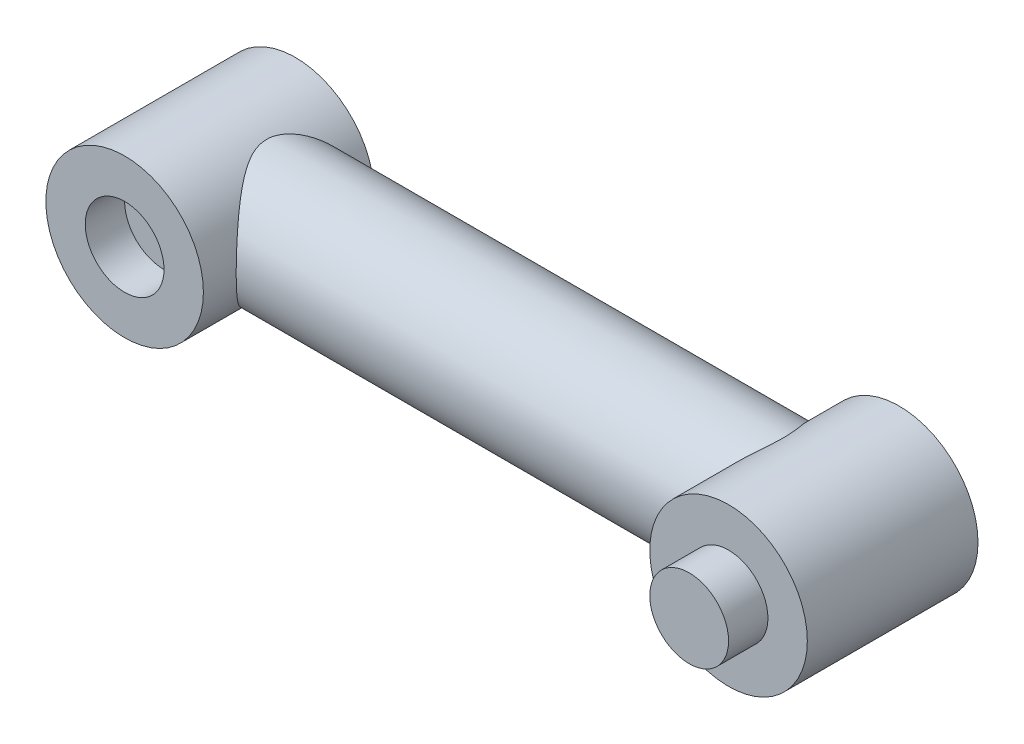
ISO-10303-21;
HEADER;
FILE_DESCRIPTION(('STEP AP214'),'2;1');
FILE_NAME('part.step','',(''),(''),'','','');
FILE_SCHEMA(('AUTOMOTIVE_DESIGN { 1 0 10303 214 1 1 1 1 }'));
ENDSEC;
DATA;
#1=APPLICATION_CONTEXT('core data for automotive mechanical design processes');
#2=APPLICATION_PROTOCOL_DEFINITION('international standard','automotive_design',2000,#1);
#3=PRODUCT_CONTEXT('',#1,'mechanical');
#4=PRODUCT('Part','Part','',(#3));
#5=PRODUCT_RELATED_PRODUCT_CATEGORY('part','',(#4));
#6=PRODUCT_DEFINITION_FORMATION('','',#4);
#7=PRODUCT_DEFINITION_CONTEXT('part definition',#1,'design');
#8=PRODUCT_DEFINITION('design','',#6,#7);
#9=PRODUCT_DEFINITION_SHAPE('','',#8);
#10=(LENGTH_UNIT() NAMED_UNIT(*) SI_UNIT(.MILLI.,.METRE.));
#11=(NAMED_UNIT(*) PLANE_ANGLE_UNIT() SI_UNIT($,.RADIAN.));
#12=(NAMED_UNIT(*) SI_UNIT($,.STERADIAN.) SOLID_ANGLE_UNIT());
#13=UNCERTAINTY_MEASURE_WITH_UNIT(LENGTH_MEASURE(1.E-05),#10,'distance_accuracy_value','');
#14=(GEOMETRIC_REPRESENTATION_CONTEXT(3) GLOBAL_UNCERTAINTY_ASSIGNED_CONTEXT((#13)) GLOBAL_UNIT_ASSIGNED_CONTEXT((#10,
#11,#12)) REPRESENTATION_CONTEXT('',''));
#15=CARTESIAN_POINT('',(0.,0.,0.));
#16=DIRECTION('',(0.,0.,1.));
#17=DIRECTION('',(1.,0.,0.));
#18=AXIS2_PLACEMENT_3D('',#15,#16,#17);
#19=CARTESIAN_POINT('',(213.416876048223,0.,0.));
#20=DIRECTION('',(1.,0.,0.));
#21=DIRECTION('',(0.,1.,0.));
#22=AXIS2_PLACEMENT_3D('',#19,#20,#21);
#23=CYLINDRICAL_SURFACE('',#22,25.);
#24=CARTESIAN_POINT('',(16.583123951777,25.,0.));
#25=CARTESIAN_POINT('',(16.5831366012148,24.9999952323958,0.441781824220458));
#26=CARTESIAN_POINT('',(16.6008708258448,24.9882561466221,0.883691822200362));
#27=CARTESIAN_POINT('',(16.670869464227,24.9416076420471,1.76370356610239));
#28=CARTESIAN_POINT('',(16.7231561656788,24.9066832677603,2.20180266892448));
#29=CARTESIAN_POINT('',(16.8597435924825,24.8144273754709,3.07182587541002));
#30=CARTESIAN_POINT('',(16.9441354241366,24.7570320769957,3.50372874225016));
#31=CARTESIAN_POINT('',(17.1410488546996,24.6211028885814,4.35755533371882));
#32=CARTESIAN_POINT('',(17.2535706469161,24.542568853378,4.77947898974898));
#33=CARTESIAN_POINT('',(17.5507240941017,24.3313967373396,5.77337353246251));
#34=CARTESIAN_POINT('',(17.7463993007367,24.1895871358199,6.3400961290561));
#35=CARTESIAN_POINT('',(18.1725513730177,23.8710930763065,7.45015470091193));
#36=CARTESIAN_POINT('',(18.4030461379086,23.6943906669795,7.99347846215703));
#37=CARTESIAN_POINT('',(18.8898181871748,23.308186615318,9.05814113569544));
#38=CARTESIAN_POINT('',(19.1461614549258,23.0986002319974,9.5794187025486));
#39=CARTESIAN_POINT('',(19.6762444124787,22.6487581917004,10.5992630499084));
#40=CARTESIAN_POINT('',(19.9499832834552,22.4085039777479,11.0978308974865));
#41=CARTESIAN_POINT('',(20.4311114544092,21.9691717213928,11.9379069848718));
#42=CARTESIAN_POINT('',(20.6358628462615,21.7771363848563,12.2846479217804));
#43=CARTESIAN_POINT('',(21.049186719466,21.3778939443505,12.9669531617967));
#44=CARTESIAN_POINT('',(21.2577595016544,21.1706856420194,13.3025165790515));
#45=CARTESIAN_POINT('',(21.8866463423768,20.526435251427,14.2928751210657));
#46=CARTESIAN_POINT('',(22.310063862815,20.0668261215966,14.9312271261069));
#47=CARTESIAN_POINT('',(23.1524695198848,19.088736163492,16.1628549930544));
#48=CARTESIAN_POINT('',(23.5714613660388,18.5703097695754,16.756171698975));
#49=CARTESIAN_POINT('',(24.3950323232926,17.4743220550127,17.8961661287464));
#50=CARTESIAN_POINT('',(24.7996168531044,16.8967832905307,18.4428614975185));
#51=CARTESIAN_POINT('',(25.5013775767801,15.8115240251136,19.3750639999918));
#52=CARTESIAN_POINT('',(25.8031338093393,15.3149777313448,19.7701647855466));
#53=CARTESIAN_POINT('',(26.3869669607359,14.2855861420082,20.5263191601657));
#54=CARTESIAN_POINT('',(26.6690446401102,13.7527422508454,20.8873740652255));
#55=CARTESIAN_POINT('',(27.2083019574202,12.6523997522784,21.5716470794608));
#56=CARTESIAN_POINT('',(27.4655138343237,12.0849476160668,21.8949142980233));
#57=CARTESIAN_POINT('',(27.9505030707714,10.9164669156548,22.5002986153881));
#58=CARTESIAN_POINT('',(28.1782857695565,10.3154444704283,22.7824231797688));
#59=CARTESIAN_POINT('',(28.5630817900107,9.18916623812263,23.2565113693688));
#60=CARTESIAN_POINT('',(28.7255222542841,8.66876856508447,23.4556303789023));
#61=CARTESIAN_POINT('',(29.0242113473194,7.60907739098481,23.820491829397));
#62=CARTESIAN_POINT('',(29.1604627370124,7.06978588886235,23.9862377887333));
#63=CARTESIAN_POINT('',(29.4042410606824,5.97534612550057,24.2820181458207));
#64=CARTESIAN_POINT('',(29.5117793420398,5.42020422461485,24.4120666517273));
#65=CARTESIAN_POINT('',(29.6960664846776,4.29735681504332,24.6345337140493));
#66=CARTESIAN_POINT('',(29.7728149917292,3.7296511618939,24.7269518375366));
#67=CARTESIAN_POINT('',(29.894143469515,2.58335712417406,24.8729063485372));
#68=CARTESIAN_POINT('',(29.9385856359746,2.00473279727435,24.9262761798646));
#69=CARTESIAN_POINT('',(29.9937700148802,0.843555485097898,24.9925304350828));
#70=CARTESIAN_POINT('',(30.004512158351,0.261002491782618,25.0054147761103));
#71=CARTESIAN_POINT('',(29.9920509076249,-0.903202051647411,24.9904608510635));
#72=CARTESIAN_POINT('',(29.9688480231611,-1.48485361516712,24.9626231964881));
#73=CARTESIAN_POINT('',(29.8890255863092,-2.64249019821805,24.8667359509782));
#74=CARTESIAN_POINT('',(29.8324071752802,-3.21847541060917,24.7986877334977));
#75=CARTESIAN_POINT('',(29.6919115029042,-4.32188063352001,24.6294877029326));
#76=CARTESIAN_POINT('',(29.610124520965,-4.84996084451036,24.5308711450691));
#77=CARTESIAN_POINT('',(29.4200820524584,-5.89409387890169,24.3011397504591));
#78=CARTESIAN_POINT('',(29.3118280335976,-6.41014736749658,24.170026715771));
#79=CARTESIAN_POINT('',(29.0706941299152,-7.42752244505315,23.8770220407384));
#80=CARTESIAN_POINT('',(28.9378136081431,-7.92884365258403,23.715129604299));
#81=CARTESIAN_POINT('',(28.6495140035056,-8.91454373106408,23.3624691179274));
#82=CARTESIAN_POINT('',(28.4940935122424,-9.39892154096496,23.1716992635725));
#83=CARTESIAN_POINT('',(28.1487811673652,-10.3896255675921,22.7457849695189));
#84=CARTESIAN_POINT('',(27.9570781792577,-10.8942874836945,22.508241084564));
#85=CARTESIAN_POINT('',(27.55267465581,-11.8799817733745,22.0039219701656));
#86=CARTESIAN_POINT('',(27.3399734707494,-12.3610134151004,21.7371458361978));
#87=CARTESIAN_POINT('',(26.8963627384536,-13.2986793879929,21.1764902882283));
#88=CARTESIAN_POINT('',(26.6654412593284,-13.7552973975899,20.8825930917889));
#89=CARTESIAN_POINT('',(26.1883497229903,-14.6432374027662,20.2698457328001));
#90=CARTESIAN_POINT('',(25.942176697448,-15.074554442147,19.9509907096374));
#91=CARTESIAN_POINT('',(25.5035971616018,-15.8017911943421,19.3767447378018));
#92=CARTESIAN_POINT('',(25.3139966288542,-16.1035842998564,19.126606114916));
#93=CARTESIAN_POINT('',(24.9292366784882,-16.6930238603694,18.6143860976976));
#94=CARTESIAN_POINT('',(24.7340781773024,-16.9806726264921,18.3523066680143));
#95=CARTESIAN_POINT('',(24.1417048671271,-17.8227095394092,17.5486047203972));
#96=CARTESIAN_POINT('',(23.7377020783523,-18.3560083061822,16.9896612498359));
#97=CARTESIAN_POINT('',(22.9205271506555,-19.3667917857263,15.8278699744457));
#98=CARTESIAN_POINT('',(22.5073412250648,-19.8441847344097,15.2249525511865));
#99=CARTESIAN_POINT('',(21.6827595888459,-20.741958103219,13.9771879452396));
#100=CARTESIAN_POINT('',(21.2713632863341,-21.1623590222537,13.3323559625171));
#101=CARTESIAN_POINT('',(20.570313442109,-21.8410863985069,12.1773688895564));
#102=CARTESIAN_POINT('',(20.2773843683201,-22.1127792281499,11.6770139447299));
#103=CARTESIAN_POINT('',(19.7052130040531,-22.6241396131043,10.6525201439375));
#104=CARTESIAN_POINT('',(19.4259715733815,-22.8638051582098,10.1283797978342));
#105=CARTESIAN_POINT('',(18.8893157111347,-23.3091172252129,9.05654242875801));
#106=CARTESIAN_POINT('',(18.6318519501994,-23.5148416917618,8.50890312368783));
#107=CARTESIAN_POINT('',(18.2687137370934,-23.7965895042857,7.66873375422734));
#108=CARTESIAN_POINT('',(18.1515285274879,-23.8860193750645,7.38560859912456));
#109=CARTESIAN_POINT('',(17.9261598643504,-24.0556159776822,6.81296878439294));
#110=CARTESIAN_POINT('',(17.8179784946916,-24.1357805667984,6.52345266513047));
#111=CARTESIAN_POINT('',(17.5762868299257,-24.3126245380053,5.83628406176584));
#112=CARTESIAN_POINT('',(17.4470688904188,-24.40533839362,5.43607219509909));
#113=CARTESIAN_POINT('',(17.2116770523324,-24.5719147926787,4.62517377015109));
#114=CARTESIAN_POINT('',(17.1054952294955,-24.6457838201501,4.21449086832961));
#115=CARTESIAN_POINT('',(16.9202047436196,-24.7733596487435,3.38473670361429));
#116=CARTESIAN_POINT('',(16.8410449730084,-24.8271045301073,2.96568288052882));
#117=CARTESIAN_POINT('',(16.7129721252634,-24.9135019866072,2.12077594217508));
#118=CARTESIAN_POINT('',(16.6640580392915,-24.9461552652507,1.69492305417419));
#119=CARTESIAN_POINT('',(16.5986496035063,-24.9897264325943,0.836426044288583));
#120=CARTESIAN_POINT('',(16.582396213055,-25.0004827808218,0.403755011962487));
#121=CARTESIAN_POINT('',(16.5839019391938,-24.9994838879298,-0.461488220990209));
#122=CARTESIAN_POINT('',(16.6016602570454,-24.9877291754651,-0.894060423699152));
#123=CARTESIAN_POINT('',(16.670280961531,-24.9420007203463,-1.75585898010219));
#124=CARTESIAN_POINT('',(16.7211821280865,-24.9080009488758,-2.18508081745021));
#125=CARTESIAN_POINT('',(16.8535827473376,-24.818603234641,-3.03649331463587));
#126=CARTESIAN_POINT('',(16.935087197923,-24.7632017966807,-3.45868281423896));
#127=CARTESIAN_POINT('',(17.1491075814031,-24.6156246850975,-4.39897778648788));
#128=CARTESIAN_POINT('',(17.2893037520623,-24.5176990448402,-4.91442919014592));
#129=CARTESIAN_POINT('',(17.6042322303701,-24.2925575265104,-5.92802688000667));
#130=CARTESIAN_POINT('',(17.778976014779,-24.1653319126285,-6.42616735066293));
#131=CARTESIAN_POINT('',(18.1558923507479,-23.8834478411874,-7.40549076677366));
#132=CARTESIAN_POINT('',(18.35813867194,-23.7287152468109,-7.88662356326774));
#133=CARTESIAN_POINT('',(18.7830211255099,-23.3938297706512,-8.830605605592));
#134=CARTESIAN_POINT('',(19.0056580072908,-23.2136759544442,-9.2934541785366));
#135=CARTESIAN_POINT('',(19.4161971706234,-22.8706508826236,-10.1036100036807));
#136=CARTESIAN_POINT('',(19.6012598375688,-22.712407431522,-10.454341331708));
#137=CARTESIAN_POINT('',(19.9782650816676,-22.3815079805079,-11.1451677554914));
#138=CARTESIAN_POINT('',(20.1702084255647,-22.2088503714966,-11.4852616579163));
#139=CARTESIAN_POINT('',(20.7534746013953,-21.6696386411748,-12.4902095221617));
#140=CARTESIAN_POINT('',(21.1521566451646,-21.2819087548985,-13.1395814466026));
#141=CARTESIAN_POINT('',(21.9564206948898,-20.4511783738654,-14.3985637197224));
#142=CARTESIAN_POINT('',(22.3620102781168,-20.0081132868537,-15.008126311791));
#143=CARTESIAN_POINT('',(23.1692338767959,-19.0675288162515,-16.1863314381231));
#144=CARTESIAN_POINT('',(23.5708686391604,-18.5700199386531,-16.7549818322138));
#145=CARTESIAN_POINT('',(24.3712563867499,-17.5070216923001,-17.8636177686038));
#146=CARTESIAN_POINT('',(24.7696713691301,-16.9401162342517,-18.4024943218484));
#147=CARTESIAN_POINT('',(25.5435603446557,-15.7490060336118,-19.4316342578554));
#148=CARTESIAN_POINT('',(25.9190300976156,-15.1247907534096,-19.9218886658064));
#149=CARTESIAN_POINT('',(26.6367264053559,-13.8215814824326,-20.8470645054507));
#150=CARTESIAN_POINT('',(26.9790445819545,-13.1427485469917,-21.2821395331859));
#151=CARTESIAN_POINT('',(27.4611211773321,-12.0845845455269,-21.8889963342783));
#152=CARTESIAN_POINT('',(27.6165561443096,-11.7252753326862,-22.0836267406133));
#153=CARTESIAN_POINT('',(27.9158939627482,-10.9935931491102,-22.4568381750428));
#154=CARTESIAN_POINT('',(28.0597941954546,-10.6212172392501,-22.6354155596979));
#155=CARTESIAN_POINT('',(28.3808657814109,-9.73731990984641,-23.0323983512802));
#156=CARTESIAN_POINT('',(28.5530488681173,-9.22094822894638,-23.2441244017879));
#157=CARTESIAN_POINT('',(28.8717934134175,-8.16834413656064,-23.6345755701641));
#158=CARTESIAN_POINT('',(29.0183618685126,-7.63211719708271,-23.8133097003534));
#159=CARTESIAN_POINT('',(29.2832478330914,-6.54258937557441,-24.1353888619601));
#160=CARTESIAN_POINT('',(29.4015799519493,-5.98929749095949,-24.2787521954041));
#161=CARTESIAN_POINT('',(29.607772463655,-4.86871003758444,-24.5280472541493));
#162=CARTESIAN_POINT('',(29.6956318526197,-4.30141400813594,-24.6339777462779));
#163=CARTESIAN_POINT('',(29.839369314993,-3.15402986834072,-24.8070615240243));
#164=CARTESIAN_POINT('',(29.895089595518,-2.57389292388828,-24.8740235006452));
#165=CARTESIAN_POINT('',(29.9726299716685,-1.40808570803851,-24.9671627430148));
#166=CARTESIAN_POINT('',(29.9944501884486,-0.822415456424069,-24.9933401545225));
#167=CARTESIAN_POINT('',(30.0036865153118,0.349560214779216,-25.0044238747035));
#168=CARTESIAN_POINT('',(29.9911041509458,0.935865605050946,-24.9893320134251));
#169=CARTESIAN_POINT('',(29.9318286762335,2.10422014892698,-24.9181611976193));
#170=CARTESIAN_POINT('',(29.8851369571535,2.68626947515138,-24.862083914822));
#171=CARTESIAN_POINT('',(29.7633289000784,3.79927589258571,-24.7155268700368));
#172=CARTESIAN_POINT('',(29.6905346071393,4.33086267890442,-24.6278551830356));
#173=CARTESIAN_POINT('',(29.5179178346671,5.38300161126335,-24.4194774717942));
#174=CARTESIAN_POINT('',(29.4180969605128,5.90355441074264,-24.2987734096725));
#175=CARTESIAN_POINT('',(29.1931669946281,6.93076433279786,-24.025964173028));
#176=CARTESIAN_POINT('',(29.0680567548376,7.43742082333742,-23.8738575729191));
#177=CARTESIAN_POINT('',(28.7945724705848,8.43444545407249,-23.5401051477637));
#178=CARTESIAN_POINT('',(28.6461970238725,8.92481261031043,-23.3584575421853));
#179=CARTESIAN_POINT('',(28.316867241363,9.92222047675422,-22.9534281849464));
#180=CARTESIAN_POINT('',(28.1343317638324,10.4278970901228,-22.7279767857666));
#181=CARTESIAN_POINT('',(27.747851097487,11.4165905133133,-22.2477762523573));
#182=CARTESIAN_POINT('',(27.543905441832,11.8996068287042,-21.993026479277));
#183=CARTESIAN_POINT('',(27.1173309021258,12.8420431074997,-21.4563781029713));
#184=CARTESIAN_POINT('',(26.8946920902104,13.3014503207343,-21.1744650615573));
#185=CARTESIAN_POINT('',(26.4335795872372,14.1957393521548,-20.585618273027));
#186=CARTESIAN_POINT('',(26.1951027756968,14.6306163058652,-20.2786795925047));
#187=CARTESIAN_POINT('',(25.76920904053,15.364826395938,-19.7249770090434));
#188=CARTESIAN_POINT('',(25.5847466179727,15.6698675226543,-19.4834653071108));
#189=CARTESIAN_POINT('',(25.2098536039898,16.2661401846875,-18.9884908651917));
#190=CARTESIAN_POINT('',(25.0194240075893,16.5573740022308,-18.7350301141881));
#191=CARTESIAN_POINT('',(24.4405776568497,17.4106431509475,-17.9572331276133));
#192=CARTESIAN_POINT('',(24.0447048832323,17.9520731314853,-17.415613228696));
#193=CARTESIAN_POINT('',(23.2414708996916,18.9805355222947,-16.2887250858063));
#194=CARTESIAN_POINT('',(22.8340890795339,19.4674614265474,-15.7033749845055));
#195=CARTESIAN_POINT('',(22.0182276387718,20.3856398991768,-14.4914973407388));
#196=CARTESIAN_POINT('',(21.6097483957232,20.8169096010733,-13.8649825607015));
#197=CARTESIAN_POINT('',(20.8906552266476,21.5355511720245,-12.7112581449637));
#198=CARTESIAN_POINT('',(20.5780592353014,21.8338299937558,-12.1920443289887));
#199=CARTESIAN_POINT('',(19.9657069040071,22.395154024793,-11.1274104827724));
#200=CARTESIAN_POINT('',(19.6659520172801,22.6581952534065,-10.5819875011952));
#201=CARTESIAN_POINT('',(19.0882549124104,23.1469512477721,-9.4651707868496));
#202=CARTESIAN_POINT('',(18.8102666080339,23.3727460631003,-8.89383620594575));
#203=CARTESIAN_POINT('',(18.285922238739,23.7852095048659,-7.72324016514529));
#204=CARTESIAN_POINT('',(18.0395478674642,23.971900814538,-7.12399514359083));
#205=CARTESIAN_POINT('',(17.6675432885235,24.2464818774923,-6.1060525197379));
#206=CARTESIAN_POINT('',(17.529328235168,24.3463902863076,-5.69517984296834));
#207=CARTESIAN_POINT('',(17.2765698442842,24.5263982456293,-4.86183399181757));
#208=CARTESIAN_POINT('',(17.1620272405923,24.6064971820652,-4.43936045827418));
#209=CARTESIAN_POINT('',(16.96130116819,24.7452855426879,-3.58569679795414));
#210=CARTESIAN_POINT('',(16.8750266144492,24.8040437983408,-3.15453951549892));
#211=CARTESIAN_POINT('',(16.7342907228524,24.899213519213,-2.28478143282819));
#212=CARTESIAN_POINT('',(16.6798076701536,24.9356402386108,-1.84618592442274));
#213=CARTESIAN_POINT('',(16.622862954957,24.9736043974491,-1.17211883702409));
#214=CARTESIAN_POINT('',(16.6079864450376,24.9834932168511,-0.938090990647982));
#215=CARTESIAN_POINT('',(16.5881126612811,24.9966928984655,-0.46938756423935));
#216=CARTESIAN_POINT('',(16.5831172313258,25.0000025329546,-0.234711871494236));
#217=CARTESIAN_POINT('',(16.583123951777,25.,0.));
#218=B_SPLINE_CURVE_WITH_KNOTS('',3,(#24,#25,#26,#27,#28,#29,#30,#31,#32,#33,#34,#35,#36,#37,
#38,#39,#40,#41,#42,#43,#44,#45,#46,#47,#48,#49,#50,#51,#52,#53,#54,#55,#56,#57,#58,#59,#60,#61,
#62,#63,#64,#65,#66,#67,#68,#69,#70,#71,#72,#73,#74,#75,#76,#77,#78,#79,#80,#81,#82,#83,#84,#85,
#86,#87,#88,#89,#90,#91,#92,#93,#94,#95,#96,#97,#98,#99,#100,#101,#102,#103,#104,#105,#106,#107,
#108,#109,#110,#111,#112,#113,#114,#115,#116,#117,#118,#119,#120,#121,#122,#123,#124,#125,#126,
#127,#128,#129,#130,#131,#132,#133,#134,#135,#136,#137,#138,#139,#140,#141,#142,#143,#144,#145,
#146,#147,#148,#149,#150,#151,#152,#153,#154,#155,#156,#157,#158,#159,#160,#161,#162,#163,#164,
#165,#166,#167,#168,#169,#170,#171,#172,#173,#174,#175,#176,#177,#178,#179,#180,#181,#182,#183,
#184,#185,#186,#187,#188,#189,#190,#191,#192,#193,#194,#195,#196,#197,#198,#199,#200,#201,#202,
#203,#204,#205,#206,#207,#208,#209,#210,#211,#212,#213,#214,#215,#216,#217),.UNSPECIFIED.,.T.,
.F.,(4,2,2,2,2,2,2,2,2,2,2,2,2,2,2,2,2,2,2,2,2,2,2,2,2,2,2,2,2,2,2,2,2,2,2,2,2,2,2,2,2,2,2,2,2,
2,2,2,2,2,2,2,2,2,2,2,2,2,2,2,2,2,2,2,2,2,2,2,2,2,2,2,2,2,2,2,2,2,2,2,2,2,2,2,2,2,2,2,2,2,2,2,2,
2,2,2,4),(0.,1.325069764287,2.65099508581599,3.98071146167146,5.31043697550967,7.15570992709509,
9.00193470291622,10.852997743334,12.7039737171308,14.0419467563765,15.3800255830397,
18.0566067441917,20.7307306776698,23.4038379934442,25.5099599411397,27.6160004462614,
29.7192727444541,31.8221629152717,33.5616073980296,35.3008684026145,37.0394410328794,
38.7780336644234,40.5239995140726,42.2699689372653,44.0159121425045,45.7617957157954,
47.3902154839188,49.0185449699129,50.6469165776124,52.2753899771122,54.0430969567823,
55.8108586495087,57.5797877575262,59.3490622312033,60.6549160974269,61.9605558788901,
64.5725966610846,67.1888664858534,69.8041927790366,71.7238615190171,73.6436506912688,
75.5589678372521,76.5163010849266,77.4738552878201,78.764746127948,80.0551922043959,
81.34318392276,82.6311326781299,83.9285490943206,85.2259350420658,86.524841775141,
87.8239607278632,89.4506151283789,91.0778108162596,92.7094605156425,94.3411702062365,
95.6216303546206,96.9022336365286,99.4639739305347,102.028732969028,104.592997957031,
107.223018948426,109.853524496451,112.476539154221,113.787600237992,115.098958136554,
116.84930691442,118.599176843967,120.348139424689,122.09715961716,123.854695414046,
125.612224929701,127.36967651058,129.12705641181,130.756235964531,132.38531876521,
134.014475537897,135.643730541541,137.390969848456,139.138247261129,140.886458588267,
142.635015384564,143.926346398347,145.217463216961,147.800413350847,150.388325802052,
152.975439665531,155.000504660364,157.025798228556,159.04668068919,161.066387605935,
162.399943471457,163.733540670484,165.06279751156,166.391145352028,167.095003154279,
167.798992289154),.UNSPECIFIED.);
#219=CARTESIAN_POINT('',(16.583123951777,25.,0.));
#220=VERTEX_POINT('',#219);
#221=EDGE_CURVE('E51',#220,#220,#218,.T.);
#222=ORIENTED_EDGE('',*,*,#221,.T.);
#223=EDGE_LOOP('',(#222));
#224=FACE_BOUND('',#223,.T.);
#225=CARTESIAN_POINT('',(213.416876048223,25.,0.));
#226=CARTESIAN_POINT('',(213.416863398785,24.9999952323958,0.44178182422046));
#227=CARTESIAN_POINT('',(213.399129174155,24.9882561466221,0.883691822200365));
#228=CARTESIAN_POINT('',(213.329130535773,24.941607642047,1.76370356610239));
#229=CARTESIAN_POINT('',(213.276843834321,24.9066832677603,2.20180266892449));
#230=CARTESIAN_POINT('',(213.140256407517,24.8144273754709,3.07182587541003));
#231=CARTESIAN_POINT('',(213.055864575863,24.7570320769957,3.50372874225017));
#232=CARTESIAN_POINT('',(212.8589511453,24.6211028885814,4.35755533371883));
#233=CARTESIAN_POINT('',(212.746429353084,24.542568853378,4.77947898974899));
#234=CARTESIAN_POINT('',(212.449275905898,24.3313967373395,5.77337353246252));
#235=CARTESIAN_POINT('',(212.253600699263,24.1895871358199,6.34009612905611));
#236=CARTESIAN_POINT('',(211.827448626982,23.8710930763065,7.45015470091194));
#237=CARTESIAN_POINT('',(211.596953862091,23.6943906669794,7.99347846215704));
#238=CARTESIAN_POINT('',(211.110181812825,23.308186615318,9.05814113569545));
#239=CARTESIAN_POINT('',(210.853838545074,23.0986002319974,9.57941870254862));
#240=CARTESIAN_POINT('',(210.323755587521,22.6487581917004,10.5992630499084));
#241=CARTESIAN_POINT('',(210.050016716545,22.4085039777479,11.0978308974865));
#242=CARTESIAN_POINT('',(209.568888545591,21.9691717213928,11.9379069848718));
#243=CARTESIAN_POINT('',(209.364137153738,21.7771363848562,12.2846479217804));
#244=CARTESIAN_POINT('',(208.950813280534,21.3778939443505,12.9669531617967));
#245=CARTESIAN_POINT('',(208.742240498346,21.1706856420194,13.3025165790515));
#246=CARTESIAN_POINT('',(208.113353657623,20.526435251427,14.2928751210657));
#247=CARTESIAN_POINT('',(207.689936137185,20.0668261215966,14.9312271261069));
#248=CARTESIAN_POINT('',(206.847530480115,19.088736163492,16.1628549930544));
#249=CARTESIAN_POINT('',(206.428538633961,18.5703097695754,16.756171698975));
#250=CARTESIAN_POINT('',(205.604967676707,17.4743220550127,17.8961661287464));
#251=CARTESIAN_POINT('',(205.200383146896,16.8967832905306,18.4428614975185));
#252=CARTESIAN_POINT('',(204.49862242322,15.8115240251136,19.3750639999918));
#253=CARTESIAN_POINT('',(204.196866190661,15.3149777313448,19.7701647855466));
#254=CARTESIAN_POINT('',(203.613033039264,14.2855861420082,20.5263191601657));
#255=CARTESIAN_POINT('',(203.33095535989,13.7527422508454,20.8873740652255));
#256=CARTESIAN_POINT('',(202.79169804258,12.6523997522784,21.5716470794608));
#257=CARTESIAN_POINT('',(202.534486165676,12.0849476160668,21.8949142980233));
#258=CARTESIAN_POINT('',(202.049496929229,10.9164669156548,22.5002986153881));
#259=CARTESIAN_POINT('',(201.821714230443,10.3154444704283,22.7824231797688));
#260=CARTESIAN_POINT('',(201.436918209989,9.18916623812263,23.2565113693688));
#261=CARTESIAN_POINT('',(201.274477745716,8.66876856508447,23.4556303789023));
#262=CARTESIAN_POINT('',(200.975788652681,7.60907739098481,23.8204918293969));
#263=CARTESIAN_POINT('',(200.839537262988,7.06978588886235,23.9862377887333));
#264=CARTESIAN_POINT('',(200.595758939318,5.97534612550058,24.2820181458207));
#265=CARTESIAN_POINT('',(200.48822065796,5.42020422461485,24.4120666517273));
#266=CARTESIAN_POINT('',(200.303933515322,4.29735681504332,24.6345337140493));
#267=CARTESIAN_POINT('',(200.227185008271,3.7296511618939,24.7269518375366));
#268=CARTESIAN_POINT('',(200.105856530485,2.58335712417406,24.8729063485372));
#269=CARTESIAN_POINT('',(200.061414364025,2.00473279727435,24.9262761798646));
#270=CARTESIAN_POINT('',(200.00622998512,0.8435554850979,24.9925304350828));
#271=CARTESIAN_POINT('',(199.995487841649,0.26100249178262,25.0054147761103));
#272=CARTESIAN_POINT('',(200.007949092375,-0.90320205164741,24.9904608510635));
#273=CARTESIAN_POINT('',(200.031151976839,-1.48485361516712,24.9626231964881));
#274=CARTESIAN_POINT('',(200.110974413691,-2.64249019821805,24.8667359509782));
#275=CARTESIAN_POINT('',(200.16759282472,-3.21847541060917,24.7986877334977));
#276=CARTESIAN_POINT('',(200.308088497096,-4.32188063352001,24.6294877029326));
#277=CARTESIAN_POINT('',(200.389875479035,-4.84996084451036,24.5308711450691));
#278=CARTESIAN_POINT('',(200.579917947542,-5.89409387890169,24.3011397504591));
#279=CARTESIAN_POINT('',(200.688171966402,-6.41014736749658,24.170026715771));
#280=CARTESIAN_POINT('',(200.929305870085,-7.42752244505316,23.8770220407384));
#281=CARTESIAN_POINT('',(201.062186391857,-7.92884365258404,23.715129604299));
#282=CARTESIAN_POINT('',(201.350485996494,-8.91454373106409,23.3624691179274));
#283=CARTESIAN_POINT('',(201.505906487758,-9.39892154096497,23.1716992635725));
#284=CARTESIAN_POINT('',(201.851218832635,-10.3896255675921,22.7457849695189));
#285=CARTESIAN_POINT('',(202.042921820742,-10.8942874836945,22.508241084564));
#286=CARTESIAN_POINT('',(202.44732534419,-11.8799817733745,22.0039219701656));
#287=CARTESIAN_POINT('',(202.660026529251,-12.3610134151004,21.7371458361978));
#288=CARTESIAN_POINT('',(203.103637261546,-13.2986793879929,21.1764902882283));
#289=CARTESIAN_POINT('',(203.334558740672,-13.7552973975899,20.8825930917889));
#290=CARTESIAN_POINT('',(203.81165027701,-14.6432374027663,20.2698457328001));
#291=CARTESIAN_POINT('',(204.057823302552,-15.074554442147,19.9509907096374));
#292=CARTESIAN_POINT('',(204.496402838398,-15.8017911943421,19.3767447378018));
#293=CARTESIAN_POINT('',(204.686003371146,-16.1035842998564,19.1266061149159));
#294=CARTESIAN_POINT('',(205.070763321512,-16.6930238603695,18.6143860976976));
#295=CARTESIAN_POINT('',(205.265921822698,-16.9806726264921,18.3523066680143));
#296=CARTESIAN_POINT('',(205.858295132873,-17.8227095394092,17.5486047203972));
#297=CARTESIAN_POINT('',(206.262297921648,-18.3560083061822,16.9896612498359));
#298=CARTESIAN_POINT('',(207.079472849344,-19.3667917857263,15.8278699744457));
#299=CARTESIAN_POINT('',(207.492658774935,-19.8441847344097,15.2249525511865));
#300=CARTESIAN_POINT('',(208.317240411154,-20.741958103219,13.9771879452396));
#301=CARTESIAN_POINT('',(208.728636713666,-21.1623590222537,13.3323559625171));
#302=CARTESIAN_POINT('',(209.429686557891,-21.8410863985069,12.1773688895564));
#303=CARTESIAN_POINT('',(209.72261563168,-22.11277922815,11.6770139447299));
#304=CARTESIAN_POINT('',(210.294786995947,-22.6241396131043,10.6525201439375));
#305=CARTESIAN_POINT('',(210.574028426619,-22.8638051582099,10.1283797978342));
#306=CARTESIAN_POINT('',(211.110684288865,-23.3091172252129,9.05654242875798));
#307=CARTESIAN_POINT('',(211.368148049801,-23.5148416917618,8.5089031236878));
#308=CARTESIAN_POINT('',(211.731286262907,-23.7965895042857,7.66873375422732));
#309=CARTESIAN_POINT('',(211.848471472512,-23.8860193750645,7.38560859912454));
#310=CARTESIAN_POINT('',(212.07384013565,-24.0556159776822,6.81296878439292));
#311=CARTESIAN_POINT('',(212.182021505308,-24.1357805667984,6.52345266513045));
#312=CARTESIAN_POINT('',(212.423713170074,-24.3126245380053,5.83628406176583));
#313=CARTESIAN_POINT('',(212.552931109581,-24.40533839362,5.43607219509908));
#314=CARTESIAN_POINT('',(212.788322947668,-24.5719147926787,4.62517377015108));
#315=CARTESIAN_POINT('',(212.894504770504,-24.6457838201501,4.2144908683296));
#316=CARTESIAN_POINT('',(213.07979525638,-24.7733596487435,3.38473670361427));
#317=CARTESIAN_POINT('',(213.158955026992,-24.8271045301073,2.9656828805288));
#318=CARTESIAN_POINT('',(213.287027874737,-24.9135019866073,2.12077594217505));
#319=CARTESIAN_POINT('',(213.335941960708,-24.9461552652508,1.69492305417416));
#320=CARTESIAN_POINT('',(213.401350396494,-24.9897264325943,0.83642604428856));
#321=CARTESIAN_POINT('',(213.417603786945,-25.0004827808218,0.403755011962464));
#322=CARTESIAN_POINT('',(213.416098060806,-24.9994838879298,-0.461488220990229));
#323=CARTESIAN_POINT('',(213.398339742955,-24.9877291754651,-0.894060423699167));
#324=CARTESIAN_POINT('',(213.329719038469,-24.9420007203463,-1.7558589801022));
#325=CARTESIAN_POINT('',(213.278817871914,-24.9080009488758,-2.18508081745022));
#326=CARTESIAN_POINT('',(213.146417252662,-24.818603234641,-3.03649331463589));
#327=CARTESIAN_POINT('',(213.064912802077,-24.7632017966807,-3.45868281423897));
#328=CARTESIAN_POINT('',(212.850892418597,-24.6156246850976,-4.3989777864879));
#329=CARTESIAN_POINT('',(212.710696247938,-24.5176990448402,-4.91442919014595));
#330=CARTESIAN_POINT('',(212.39576776963,-24.2925575265104,-5.9280268800067));
#331=CARTESIAN_POINT('',(212.221023985221,-24.1653319126285,-6.42616735066296));
#332=CARTESIAN_POINT('',(211.844107649252,-23.8834478411874,-7.40549076677371));
#333=CARTESIAN_POINT('',(211.64186132806,-23.7287152468109,-7.88662356326778));
#334=CARTESIAN_POINT('',(211.21697887449,-23.3938297706512,-8.83060560559205));
#335=CARTESIAN_POINT('',(210.994341992709,-23.2136759544442,-9.29345417853664));
#336=CARTESIAN_POINT('',(210.583802829377,-22.8706508826236,-10.1036100036807));
#337=CARTESIAN_POINT('',(210.398740162431,-22.712407431522,-10.454341331708));
#338=CARTESIAN_POINT('',(210.021734918332,-22.3815079805079,-11.1451677554914));
#339=CARTESIAN_POINT('',(209.829791574435,-22.2088503714965,-11.4852616579163));
#340=CARTESIAN_POINT('',(209.246525398605,-21.6696386411748,-12.4902095221618));
#341=CARTESIAN_POINT('',(208.847843354835,-21.2819087548985,-13.1395814466026));
#342=CARTESIAN_POINT('',(208.04357930511,-20.4511783738654,-14.3985637197225));
#343=CARTESIAN_POINT('',(207.637989721883,-20.0081132868536,-15.0081263117911));
#344=CARTESIAN_POINT('',(206.830766123204,-19.0675288162514,-16.1863314381231));
#345=CARTESIAN_POINT('',(206.42913136084,-18.5700199386531,-16.7549818322138));
#346=CARTESIAN_POINT('',(205.62874361325,-17.5070216923001,-17.8636177686038));
#347=CARTESIAN_POINT('',(205.23032863087,-16.9401162342516,-18.4024943218484));
#348=CARTESIAN_POINT('',(204.456439655344,-15.7490060336118,-19.4316342578554));
#349=CARTESIAN_POINT('',(204.080969902384,-15.1247907534095,-19.9218886658064));
#350=CARTESIAN_POINT('',(203.363273594644,-13.8215814824325,-20.8470645054507));
#351=CARTESIAN_POINT('',(203.020955418046,-13.1427485469916,-21.2821395331859));
#352=CARTESIAN_POINT('',(202.538878822668,-12.0845845455269,-21.8889963342783));
#353=CARTESIAN_POINT('',(202.38344385569,-11.7252753326862,-22.0836267406134));
#354=CARTESIAN_POINT('',(202.084106037252,-10.9935931491102,-22.4568381750428));
#355=CARTESIAN_POINT('',(201.940205804545,-10.6212172392501,-22.6354155596979));
#356=CARTESIAN_POINT('',(201.619134218589,-9.73731990984638,-23.0323983512802));
#357=CARTESIAN_POINT('',(201.446951131883,-9.22094822894635,-23.244124401788));
#358=CARTESIAN_POINT('',(201.128206586582,-8.16834413656061,-23.6345755701641));
#359=CARTESIAN_POINT('',(200.981638131487,-7.63211719708267,-23.8133097003534));
#360=CARTESIAN_POINT('',(200.716752166909,-6.54258937557438,-24.1353888619602));
#361=CARTESIAN_POINT('',(200.598420048051,-5.98929749095946,-24.2787521954042));
#362=CARTESIAN_POINT('',(200.392227536345,-4.86871003758441,-24.5280472541493));
#363=CARTESIAN_POINT('',(200.30436814738,-4.30141400813591,-24.6339777462779));
#364=CARTESIAN_POINT('',(200.160630685007,-3.15402986834068,-24.8070615240243));
#365=CARTESIAN_POINT('',(200.104910404482,-2.57389292388824,-24.8740235006452));
#366=CARTESIAN_POINT('',(200.027370028331,-1.40808570803848,-24.9671627430148));
#367=CARTESIAN_POINT('',(200.005549811551,-0.822415456424038,-24.9933401545225));
#368=CARTESIAN_POINT('',(199.996313484688,0.349560214779243,-25.0044238747035));
#369=CARTESIAN_POINT('',(200.008895849054,0.935865605050973,-24.9893320134251));
#370=CARTESIAN_POINT('',(200.068171323766,2.104220148927,-24.9181611976193));
#371=CARTESIAN_POINT('',(200.114863042846,2.6862694751514,-24.862083914822));
#372=CARTESIAN_POINT('',(200.236671099922,3.79927589258574,-24.7155268700368));
#373=CARTESIAN_POINT('',(200.309465392861,4.33086267890445,-24.6278551830356));
#374=CARTESIAN_POINT('',(200.482082165333,5.38300161126338,-24.4194774717942));
#375=CARTESIAN_POINT('',(200.581903039487,5.90355441074267,-24.2987734096725));
#376=CARTESIAN_POINT('',(200.806833005372,6.93076433279788,-24.025964173028));
#377=CARTESIAN_POINT('',(200.931943245162,7.43742082333745,-23.8738575729191));
#378=CARTESIAN_POINT('',(201.205427529415,8.43444545407252,-23.5401051477637));
#379=CARTESIAN_POINT('',(201.353802976127,8.92481261031046,-23.3584575421853));
#380=CARTESIAN_POINT('',(201.683132758637,9.92222047675425,-22.9534281849464));
#381=CARTESIAN_POINT('',(201.865668236168,10.4278970901228,-22.7279767857666));
#382=CARTESIAN_POINT('',(202.252148902513,11.4165905133133,-22.2477762523573));
#383=CARTESIAN_POINT('',(202.456094558168,11.8996068287042,-21.993026479277));
#384=CARTESIAN_POINT('',(202.882669097874,12.8420431074997,-21.4563781029712));
#385=CARTESIAN_POINT('',(203.10530790979,13.3014503207344,-21.1744650615573));
#386=CARTESIAN_POINT('',(203.566420412763,14.1957393521548,-20.585618273027));
#387=CARTESIAN_POINT('',(203.804897224303,14.6306163058652,-20.2786795925047));
#388=CARTESIAN_POINT('',(204.23079095947,15.364826395938,-19.7249770090434));
#389=CARTESIAN_POINT('',(204.415253382027,15.6698675226544,-19.4834653071108));
#390=CARTESIAN_POINT('',(204.79014639601,16.2661401846875,-18.9884908651917));
#391=CARTESIAN_POINT('',(204.980575992411,16.5573740022309,-18.7350301141881));
#392=CARTESIAN_POINT('',(205.55942234315,17.4106431509475,-17.9572331276133));
#393=CARTESIAN_POINT('',(205.955295116768,17.9520731314854,-17.415613228696));
#394=CARTESIAN_POINT('',(206.758529100308,18.9805355222947,-16.2887250858063));
#395=CARTESIAN_POINT('',(207.165910920466,19.4674614265474,-15.7033749845055));
#396=CARTESIAN_POINT('',(207.981772361228,20.3856398991768,-14.4914973407388));
#397=CARTESIAN_POINT('',(208.390251604277,20.8169096010733,-13.8649825607014));
#398=CARTESIAN_POINT('',(209.109344773352,21.5355511720245,-12.7112581449637));
#399=CARTESIAN_POINT('',(209.421940764699,21.8338299937559,-12.1920443289886));
#400=CARTESIAN_POINT('',(210.034293095993,22.395154024793,-11.1274104827723));
#401=CARTESIAN_POINT('',(210.33404798272,22.6581952534065,-10.5819875011952));
#402=CARTESIAN_POINT('',(210.91174508759,23.1469512477721,-9.46517078684955));
#403=CARTESIAN_POINT('',(211.189733391966,23.3727460631003,-8.89383620594571));
#404=CARTESIAN_POINT('',(211.714077761261,23.7852095048659,-7.72324016514527));
#405=CARTESIAN_POINT('',(211.960452132536,23.971900814538,-7.1239951435908));
#406=CARTESIAN_POINT('',(212.332456711477,24.2464818774923,-6.10605251973788));
#407=CARTESIAN_POINT('',(212.470671764832,24.3463902863075,-5.69517984296831));
#408=CARTESIAN_POINT('',(212.723430155716,24.5263982456293,-4.86183399181754));
#409=CARTESIAN_POINT('',(212.837972759408,24.6064971820652,-4.43936045827415));
#410=CARTESIAN_POINT('',(213.03869883181,24.7452855426879,-3.5856967979541));
#411=CARTESIAN_POINT('',(213.124973385551,24.8040437983408,-3.15453951549889));
#412=CARTESIAN_POINT('',(213.265709277148,24.899213519213,-2.28478143282814));
#413=CARTESIAN_POINT('',(213.320192329846,24.9356402386108,-1.84618592442269));
#414=CARTESIAN_POINT('',(213.377137045043,24.9736043974491,-1.17211883702404));
#415=CARTESIAN_POINT('',(213.392013554962,24.9834932168511,-0.938090990647948));
#416=CARTESIAN_POINT('',(213.411887338719,24.9966928984655,-0.469387564239333));
#417=CARTESIAN_POINT('',(213.416882768674,25.0000025329546,-0.234711871494227));
#418=CARTESIAN_POINT('',(213.416876048223,25.,0.));
#419=B_SPLINE_CURVE_WITH_KNOTS('',3,(#225,#226,#227,#228,#229,#230,#231,#232,#233,#234,#235,
#236,#237,#238,#239,#240,#241,#242,#243,#244,#245,#246,#247,#248,#249,#250,#251,#252,#253,#254,
#255,#256,#257,#258,#259,#260,#261,#262,#263,#264,#265,#266,#267,#268,#269,#270,#271,#272,#273,
#274,#275,#276,#277,#278,#279,#280,#281,#282,#283,#284,#285,#286,#287,#288,#289,#290,#291,#292,
#293,#294,#295,#296,#297,#298,#299,#300,#301,#302,#303,#304,#305,#306,#307,#308,#309,#310,#311,
#312,#313,#314,#315,#316,#317,#318,#319,#320,#321,#322,#323,#324,#325,#326,#327,#328,#329,#330,
#331,#332,#333,#334,#335,#336,#337,#338,#339,#340,#341,#342,#343,#344,#345,#346,#347,#348,#349,
#350,#351,#352,#353,#354,#355,#356,#357,#358,#359,#360,#361,#362,#363,#364,#365,#366,#367,#368,
#369,#370,#371,#372,#373,#374,#375,#376,#377,#378,#379,#380,#381,#382,#383,#384,#385,#386,#387,
#388,#389,#390,#391,#392,#393,#394,#395,#396,#397,#398,#399,#400,#401,#402,#403,#404,#405,#406,
#407,#408,#409,#410,#411,#412,#413,#414,#415,#416,#417,#418),.UNSPECIFIED.,.T.,.F.,(4,2,2,2,2,2,
2,2,2,2,2,2,2,2,2,2,2,2,2,2,2,2,2,2,2,2,2,2,2,2,2,2,2,2,2,2,2,2,2,2,2,2,2,2,2,2,2,2,2,2,2,2,2,2,
2,2,2,2,2,2,2,2,2,2,2,2,2,2,2,2,2,2,2,2,2,2,2,2,2,2,2,2,2,2,2,2,2,2,2,2,2,2,2,2,2,2,4),(0.,
1.32506976428701,2.650995085816,3.98071146167147,5.31043697550968,7.15570992709509,
9.00193470291623,10.852997743334,12.7039737171308,14.0419467563765,15.3800255830397,
18.0566067441917,20.7307306776698,23.4038379934442,25.5099599411396,27.6160004462614,
29.7192727444541,31.8221629152717,33.5616073980295,35.3008684026145,37.0394410328794,
38.7780336644234,40.5239995140725,42.2699689372652,44.0159121425045,45.7617957157954,
47.3902154839188,49.0185449699129,50.6469165776124,52.2753899771121,54.0430969567823,
55.8108586495086,57.5797877575262,59.3490622312032,60.6549160974269,61.96055587889,
64.5725966610846,67.1888664858533,69.8041927790366,71.723861519017,73.6436506912688,
75.5589678372521,76.5163010849265,77.4738552878201,78.764746127948,80.0551922043959,
81.34318392276,82.6311326781299,83.9285490943206,85.2259350420657,86.524841775141,
87.8239607278632,89.4506151283789,91.0778108162596,92.7094605156425,94.3411702062365,
95.6216303546206,96.9022336365286,99.4639739305348,102.028732969028,104.592997957031,
107.223018948426,109.853524496451,112.476539154221,113.787600237992,115.098958136554,
116.84930691442,118.599176843967,120.348139424689,122.09715961716,123.854695414046,
125.612224929701,127.36967651058,129.12705641181,130.756235964531,132.38531876521,
134.014475537897,135.643730541541,137.390969848456,139.138247261129,140.886458588267,
142.635015384564,143.926346398347,145.217463216961,147.800413350847,150.388325802052,
152.975439665531,155.000504660364,157.025798228556,159.04668068919,161.066387605935,
162.399943471457,163.733540670484,165.06279751156,166.391145352028,167.095003154279,
167.798992289154),.UNSPECIFIED.);
#420=CARTESIAN_POINT('',(213.416876048223,25.,0.));
#421=VERTEX_POINT('',#420);
#422=EDGE_CURVE('E77',#421,#421,#419,.T.);
#423=ORIENTED_EDGE('',*,*,#422,.F.);
#424=EDGE_LOOP('',(#423));
#425=FACE_BOUND('',#424,.T.);
#426=ADVANCED_FACE('F46',(#224,#425),#23,.T.);
#427=CARTESIAN_POINT('',(0.,0.,37.5));
#428=DIRECTION('',(0.,0.,-1.));
#429=DIRECTION('',(-1.,0.,0.));
#430=AXIS2_PLACEMENT_3D('',#427,#428,#429);
#431=CYLINDRICAL_SURFACE('',#430,30.);
#432=CARTESIAN_POINT('',(0.,0.,37.5));
#433=DIRECTION('',(0.,0.,1.));
#434=DIRECTION('',(1.,0.,0.));
#435=AXIS2_PLACEMENT_3D('',#432,#433,#434);
#436=CIRCLE('',#435,30.);
#437=CARTESIAN_POINT('',(30.,0.,37.5));
#438=VERTEX_POINT('',#437);
#439=EDGE_CURVE('E63',#438,#438,#436,.T.);
#440=ORIENTED_EDGE('',*,*,#439,.F.);
#441=EDGE_LOOP('',(#440));
#442=FACE_BOUND('',#441,.T.);
#443=CARTESIAN_POINT('',(0.,0.,-27.5));
#444=DIRECTION('',(0.,0.,1.));
#445=DIRECTION('',(1.,0.,0.));
#446=AXIS2_PLACEMENT_3D('',#443,#444,#445);
#447=CIRCLE('',#446,30.);
#448=CARTESIAN_POINT('',(30.,0.,-27.5));
#449=VERTEX_POINT('',#448);
#450=EDGE_CURVE('E86',#449,#449,#447,.T.);
#451=ORIENTED_EDGE('',*,*,#450,.T.);
#452=EDGE_LOOP('',(#451));
#453=FACE_BOUND('',#452,.T.);
#454=ORIENTED_EDGE('',*,*,#221,.F.);
#455=EDGE_LOOP('',(#454));
#456=FACE_BOUND('',#455,.T.);
#457=ADVANCED_FACE('F48',(#442,#453,#456),#431,.T.);
#458=CARTESIAN_POINT('',(0.,0.,37.5));
#459=DIRECTION('',(0.,0.,1.));
#460=DIRECTION('',(1.,0.,0.));
#461=AXIS2_PLACEMENT_3D('',#458,#459,#460);
#462=PLANE('',#461);
#463=CARTESIAN_POINT('',(0.,0.,37.5));
#464=DIRECTION('',(0.,0.,1.));
#465=DIRECTION('',(1.,0.,0.));
#466=AXIS2_PLACEMENT_3D('',#463,#464,#465);
#467=CIRCLE('',#466,15.);
#468=CARTESIAN_POINT('',(15.,0.,37.5));
#469=VERTEX_POINT('',#468);
#470=EDGE_CURVE('E71',#469,#469,#467,.T.);
#471=ORIENTED_EDGE('',*,*,#470,.F.);
#472=EDGE_LOOP('',(#471));
#473=FACE_BOUND('',#472,.T.);
#474=ORIENTED_EDGE('',*,*,#439,.T.);
#475=EDGE_LOOP('',(#474));
#476=FACE_BOUND('',#475,.T.);
#477=ADVANCED_FACE('F126',(#473,#476),#462,.T.);
#478=CARTESIAN_POINT('',(0.,0.,-27.5));
#479=DIRECTION('',(0.,0.,1.));
#480=DIRECTION('',(1.,0.,0.));
#481=AXIS2_PLACEMENT_3D('',#478,#479,#480);
#482=PLANE('',#481);
#483=ORIENTED_EDGE('',*,*,#450,.F.);
#484=EDGE_LOOP('',(#483));
#485=FACE_BOUND('',#484,.T.);
#486=ADVANCED_FACE('F94',(#485),#482,.F.);
#487=CARTESIAN_POINT('',(230.,0.,37.5));
#488=DIRECTION('',(0.,0.,-1.));
#489=DIRECTION('',(-1.,0.,0.));
#490=AXIS2_PLACEMENT_3D('',#487,#488,#489);
#491=CYLINDRICAL_SURFACE('',#490,30.);
#492=CARTESIAN_POINT('',(230.,0.,37.5));
#493=DIRECTION('',(0.,0.,1.));
#494=DIRECTION('',(1.,0.,0.));
#495=AXIS2_PLACEMENT_3D('',#492,#493,#494);
#496=CIRCLE('',#495,30.);
#497=CARTESIAN_POINT('',(260.,0.,37.5));
#498=VERTEX_POINT('',#497);
#499=EDGE_CURVE('E74',#498,#498,#496,.T.);
#500=ORIENTED_EDGE('',*,*,#499,.F.);
#501=EDGE_LOOP('',(#500));
#502=FACE_BOUND('',#501,.T.);
#503=CARTESIAN_POINT('',(230.,0.,-27.5));
#504=DIRECTION('',(0.,0.,1.));
#505=DIRECTION('',(1.,0.,0.));
#506=AXIS2_PLACEMENT_3D('',#503,#504,#505);
#507=CIRCLE('',#506,30.);
#508=CARTESIAN_POINT('',(260.,0.,-27.5));
#509=VERTEX_POINT('',#508);
#510=EDGE_CURVE('E70',#509,#509,#507,.T.);
#511=ORIENTED_EDGE('',*,*,#510,.T.);
#512=EDGE_LOOP('',(#511));
#513=FACE_BOUND('',#512,.T.);
#514=ORIENTED_EDGE('',*,*,#422,.T.);
#515=EDGE_LOOP('',(#514));
#516=FACE_BOUND('',#515,.T.);
#517=ADVANCED_FACE('F89',(#502,#513,#516),#491,.T.);
#518=CARTESIAN_POINT('',(0.,0.,37.5));
#519=DIRECTION('',(0.,0.,1.));
#520=DIRECTION('',(1.,0.,0.));
#521=AXIS2_PLACEMENT_3D('',#518,#519,#520);
#522=PLANE('',#521);
#523=CARTESIAN_POINT('',(230.,0.,37.5));
#524=DIRECTION('',(0.,0.,1.));
#525=DIRECTION('',(1.,0.,0.));
#526=AXIS2_PLACEMENT_3D('',#523,#524,#525);
#527=CIRCLE('',#526,15.);
#528=CARTESIAN_POINT('',(245.,0.,37.5));
#529=VERTEX_POINT('',#528);
#530=EDGE_CURVE('E12',#529,#529,#527,.T.);
#531=ORIENTED_EDGE('',*,*,#530,.F.);
#532=EDGE_LOOP('',(#531));
#533=FACE_BOUND('',#532,.T.);
#534=ORIENTED_EDGE('',*,*,#499,.T.);
#535=EDGE_LOOP('',(#534));
#536=FACE_BOUND('',#535,.T.);
#537=ADVANCED_FACE('F93',(#533,#536),#522,.T.);
#538=CARTESIAN_POINT('',(0.,0.,-27.5));
#539=DIRECTION('',(0.,0.,1.));
#540=DIRECTION('',(1.,0.,0.));
#541=AXIS2_PLACEMENT_3D('',#538,#539,#540);
#542=PLANE('',#541);
#543=ORIENTED_EDGE('',*,*,#510,.F.);
#544=EDGE_LOOP('',(#543));
#545=FACE_BOUND('',#544,.T.);
#546=ADVANCED_FACE('F96',(#545),#542,.F.);
#547=CARTESIAN_POINT('',(0.,0.,22.5));
#548=DIRECTION('',(0.,0.,1.));
#549=DIRECTION('',(1.,0.,0.));
#550=AXIS2_PLACEMENT_3D('',#547,#548,#549);
#551=CYLINDRICAL_SURFACE('',#550,15.);
#552=CARTESIAN_POINT('',(0.,0.,22.5));
#553=DIRECTION('',(0.,0.,1.));
#554=DIRECTION('',(1.,0.,0.));
#555=AXIS2_PLACEMENT_3D('',#552,#553,#554);
#556=CIRCLE('',#555,15.);
#557=CARTESIAN_POINT('',(15.,0.,22.5));
#558=VERTEX_POINT('',#557);
#559=EDGE_CURVE('E67',#558,#558,#556,.T.);
#560=ORIENTED_EDGE('',*,*,#559,.F.);
#561=EDGE_LOOP('',(#560));
#562=FACE_BOUND('',#561,.T.);
#563=ORIENTED_EDGE('',*,*,#470,.T.);
#564=EDGE_LOOP('',(#563));
#565=FACE_BOUND('',#564,.T.);
#566=ADVANCED_FACE('F99',(#562,#565),#551,.F.);
#567=CARTESIAN_POINT('',(0.,0.,22.5));
#568=DIRECTION('',(0.,0.,1.));
#569=DIRECTION('',(1.,0.,0.));
#570=AXIS2_PLACEMENT_3D('',#567,#568,#569);
#571=PLANE('',#570);
#572=ORIENTED_EDGE('',*,*,#559,.T.);
#573=EDGE_LOOP('',(#572));
#574=FACE_BOUND('',#573,.T.);
#575=ADVANCED_FACE('F106',(#574),#571,.T.);
#576=CARTESIAN_POINT('',(230.,0.,52.5));
#577=DIRECTION('',(0.,0.,-1.));
#578=DIRECTION('',(-1.,0.,0.));
#579=AXIS2_PLACEMENT_3D('',#576,#577,#578);
#580=CYLINDRICAL_SURFACE('',#579,15.);
#581=CARTESIAN_POINT('',(230.,0.,52.5));
#582=DIRECTION('',(0.,0.,1.));
#583=DIRECTION('',(1.,0.,0.));
#584=AXIS2_PLACEMENT_3D('',#581,#582,#583);
#585=CIRCLE('',#584,15.);
#586=CARTESIAN_POINT('',(245.,0.,52.5));
#587=VERTEX_POINT('',#586);
#588=EDGE_CURVE('E66',#587,#587,#585,.T.);
#589=ORIENTED_EDGE('',*,*,#588,.F.);
#590=EDGE_LOOP('',(#589));
#591=FACE_BOUND('',#590,.T.);
#592=ORIENTED_EDGE('',*,*,#530,.T.);
#593=EDGE_LOOP('',(#592));
#594=FACE_BOUND('',#593,.T.);
#595=ADVANCED_FACE('F110',(#591,#594),#580,.T.);
#596=CARTESIAN_POINT('',(230.,0.,52.5));
#597=DIRECTION('',(0.,0.,1.));
#598=DIRECTION('',(1.,0.,0.));
#599=AXIS2_PLACEMENT_3D('',#596,#597,#598);
#600=PLANE('',#599);
#601=ORIENTED_EDGE('',*,*,#588,.T.);
#602=EDGE_LOOP('',(#601));
#603=FACE_BOUND('',#602,.T.);
#604=ADVANCED_FACE('F114',(#603),#600,.T.);
#605=CLOSED_SHELL('',(#426,#457,#477,#486,#517,#537,#546,#566,#575,#595,#604));
#606=MANIFOLD_SOLID_BREP('B2',#605);
#607=ADVANCED_BREP_SHAPE_REPRESENTATION('',(#18,#606),#14);
#608=SHAPE_DEFINITION_REPRESENTATION(#9,#607);
ENDSEC;
END-ISO-10303-21;
